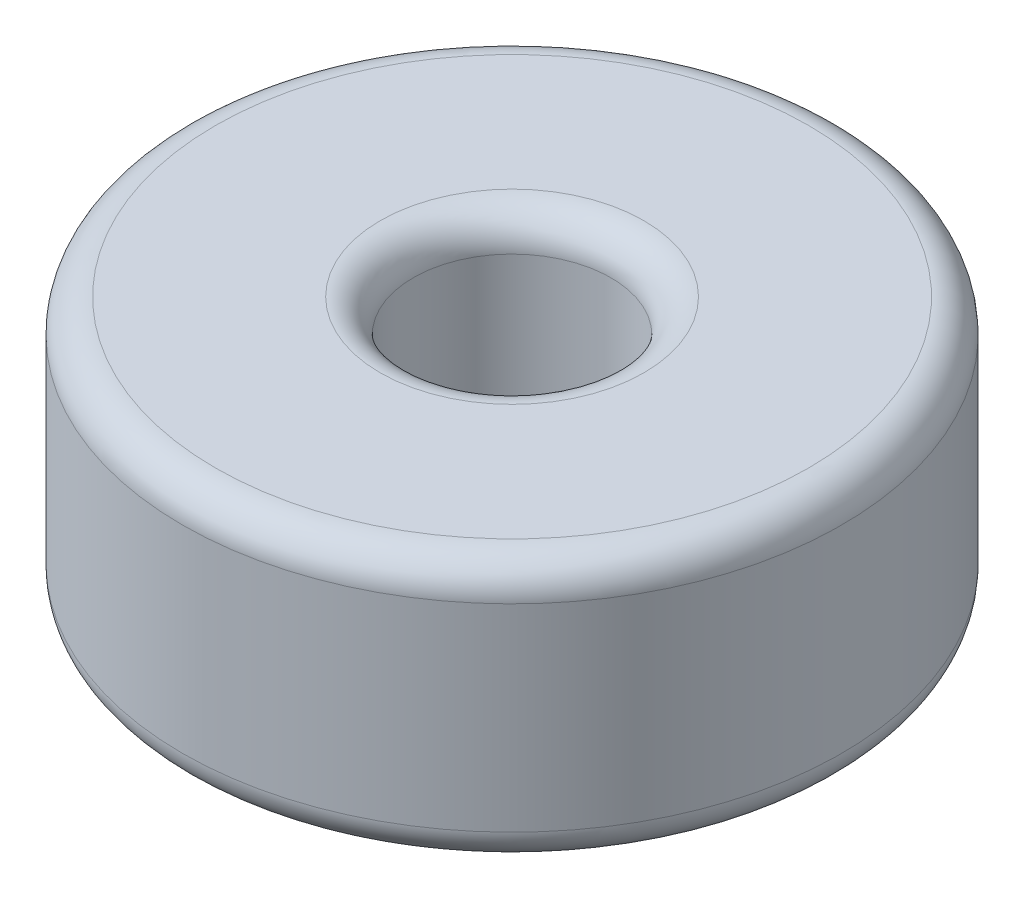
ISO-10303-21;
HEADER;
FILE_DESCRIPTION(('STEP AP214'),'2;1');
FILE_NAME('part.step','',(''),(''),'','','');
FILE_SCHEMA(('AUTOMOTIVE_DESIGN { 1 0 10303 214 1 1 1 1 }'));
ENDSEC;
DATA;
#1=APPLICATION_CONTEXT('core data for automotive mechanical design processes');
#2=APPLICATION_PROTOCOL_DEFINITION('international standard','automotive_design',2000,#1);
#3=PRODUCT_CONTEXT('',#1,'mechanical');
#4=PRODUCT('Part','Part','',(#3));
#5=PRODUCT_RELATED_PRODUCT_CATEGORY('part','',(#4));
#6=PRODUCT_DEFINITION_FORMATION('','',#4);
#7=PRODUCT_DEFINITION_CONTEXT('part definition',#1,'design');
#8=PRODUCT_DEFINITION('design','',#6,#7);
#9=PRODUCT_DEFINITION_SHAPE('','',#8);
#10=(LENGTH_UNIT() NAMED_UNIT(*) SI_UNIT(.MILLI.,.METRE.));
#11=(NAMED_UNIT(*) PLANE_ANGLE_UNIT() SI_UNIT($,.RADIAN.));
#12=(NAMED_UNIT(*) SI_UNIT($,.STERADIAN.) SOLID_ANGLE_UNIT());
#13=UNCERTAINTY_MEASURE_WITH_UNIT(LENGTH_MEASURE(1.E-05),#10,'distance_accuracy_value','');
#14=(GEOMETRIC_REPRESENTATION_CONTEXT(3) GLOBAL_UNCERTAINTY_ASSIGNED_CONTEXT((#13)) GLOBAL_UNIT_ASSIGNED_CONTEXT((#10,
#11,#12)) REPRESENTATION_CONTEXT('',''));
#15=CARTESIAN_POINT('',(0.,0.,0.));
#16=DIRECTION('',(0.,0.,1.));
#17=DIRECTION('',(1.,0.,0.));
#18=AXIS2_PLACEMENT_3D('',#15,#16,#17);
#19=CARTESIAN_POINT('',(0.,4.,0.));
#20=DIRECTION('',(0.,1.,0.));
#21=DIRECTION('',(0.,0.,1.));
#22=AXIS2_PLACEMENT_3D('',#19,#20,#21);
#23=PLANE('',#22);
#24=CARTESIAN_POINT('',(0.,4.,0.));
#25=DIRECTION('',(0.,1.,0.));
#26=DIRECTION('',(0.,0.,1.));
#27=AXIS2_PLACEMENT_3D('',#24,#25,#26);
#28=CIRCLE('',#27,2.);
#29=CARTESIAN_POINT('',(0.,4.,2.));
#30=VERTEX_POINT('',#29);
#31=EDGE_CURVE('E50',#30,#30,#28,.F.);
#32=ORIENTED_EDGE('',*,*,#31,.T.);
#33=EDGE_LOOP('',(#32));
#34=FACE_BOUND('',#33,.T.);
#35=CARTESIAN_POINT('',(0.,4.,0.));
#36=DIRECTION('',(0.,1.,0.));
#37=DIRECTION('',(0.,0.,1.));
#38=AXIS2_PLACEMENT_3D('',#35,#36,#37);
#39=CIRCLE('',#38,4.5);
#40=CARTESIAN_POINT('',(0.,4.,4.5));
#41=VERTEX_POINT('',#40);
#42=EDGE_CURVE('E55',#41,#41,#39,.T.);
#43=ORIENTED_EDGE('',*,*,#42,.T.);
#44=EDGE_LOOP('',(#43));
#45=FACE_BOUND('',#44,.T.);
#46=ADVANCED_FACE('F37',(#34,#45),#23,.T.);
#47=CARTESIAN_POINT('',(0.,0.,0.));
#48=DIRECTION('',(0.,1.,0.));
#49=DIRECTION('',(0.,0.,1.));
#50=AXIS2_PLACEMENT_3D('',#47,#48,#49);
#51=PLANE('',#50);
#52=CARTESIAN_POINT('',(0.,0.,0.));
#53=DIRECTION('',(0.,1.,0.));
#54=DIRECTION('',(0.,0.,1.));
#55=AXIS2_PLACEMENT_3D('',#52,#53,#54);
#56=CIRCLE('',#55,2.);
#57=CARTESIAN_POINT('',(0.,0.,2.));
#58=VERTEX_POINT('',#57);
#59=EDGE_CURVE('E69',#58,#58,#56,.T.);
#60=ORIENTED_EDGE('',*,*,#59,.T.);
#61=EDGE_LOOP('',(#60));
#62=FACE_BOUND('',#61,.T.);
#63=CARTESIAN_POINT('',(0.,0.,0.));
#64=DIRECTION('',(0.,1.,0.));
#65=DIRECTION('',(0.,0.,1.));
#66=AXIS2_PLACEMENT_3D('',#63,#64,#65);
#67=CIRCLE('',#66,4.5);
#68=CARTESIAN_POINT('',(0.,0.,4.5));
#69=VERTEX_POINT('',#68);
#70=EDGE_CURVE('E73',#69,#69,#67,.F.);
#71=ORIENTED_EDGE('',*,*,#70,.T.);
#72=EDGE_LOOP('',(#71));
#73=FACE_BOUND('',#72,.T.);
#74=ADVANCED_FACE('F78',(#62,#73),#51,.F.);
#75=CARTESIAN_POINT('',(0.,4.,0.));
#76=DIRECTION('',(0.,-1.,0.));
#77=DIRECTION('',(0.,0.,-1.));
#78=AXIS2_PLACEMENT_3D('',#75,#76,#77);
#79=CYLINDRICAL_SURFACE('',#78,5.);
#80=CARTESIAN_POINT('',(0.,0.5,0.));
#81=DIRECTION('',(0.,1.,0.));
#82=DIRECTION('',(0.,0.,1.));
#83=AXIS2_PLACEMENT_3D('',#80,#81,#82);
#84=CIRCLE('',#83,5.);
#85=CARTESIAN_POINT('',(0.,0.5,5.));
#86=VERTEX_POINT('',#85);
#87=EDGE_CURVE('E10',#86,#86,#84,.T.);
#88=ORIENTED_EDGE('',*,*,#87,.T.);
#89=EDGE_LOOP('',(#88));
#90=FACE_BOUND('',#89,.T.);
#91=CARTESIAN_POINT('',(0.,3.5,0.));
#92=DIRECTION('',(0.,1.,0.));
#93=DIRECTION('',(0.,0.,1.));
#94=AXIS2_PLACEMENT_3D('',#91,#92,#93);
#95=CIRCLE('',#94,5.);
#96=CARTESIAN_POINT('',(0.,3.5,5.));
#97=VERTEX_POINT('',#96);
#98=EDGE_CURVE('E45',#97,#97,#95,.F.);
#99=ORIENTED_EDGE('',*,*,#98,.T.);
#100=EDGE_LOOP('',(#99));
#101=FACE_BOUND('',#100,.T.);
#102=ADVANCED_FACE('F98',(#90,#101),#79,.T.);
#103=CARTESIAN_POINT('',(0.,4.,0.));
#104=DIRECTION('',(0.,-1.,0.));
#105=DIRECTION('',(0.,0.,-1.));
#106=AXIS2_PLACEMENT_3D('',#103,#104,#105);
#107=CYLINDRICAL_SURFACE('',#106,1.5);
#108=CARTESIAN_POINT('',(0.,0.5,0.));
#109=DIRECTION('',(0.,1.,0.));
#110=DIRECTION('',(0.,0.,1.));
#111=AXIS2_PLACEMENT_3D('',#108,#109,#110);
#112=CIRCLE('',#111,1.5);
#113=CARTESIAN_POINT('',(0.,0.5,1.5));
#114=VERTEX_POINT('',#113);
#115=EDGE_CURVE('E61',#114,#114,#112,.F.);
#116=ORIENTED_EDGE('',*,*,#115,.T.);
#117=EDGE_LOOP('',(#116));
#118=FACE_BOUND('',#117,.T.);
#119=CARTESIAN_POINT('',(0.,3.5,0.));
#120=DIRECTION('',(0.,1.,0.));
#121=DIRECTION('',(0.,0.,1.));
#122=AXIS2_PLACEMENT_3D('',#119,#120,#121);
#123=CIRCLE('',#122,1.5);
#124=CARTESIAN_POINT('',(0.,3.5,1.5));
#125=VERTEX_POINT('',#124);
#126=EDGE_CURVE('E65',#125,#125,#123,.T.);
#127=ORIENTED_EDGE('',*,*,#126,.T.);
#128=EDGE_LOOP('',(#127));
#129=FACE_BOUND('',#128,.T.);
#130=ADVANCED_FACE('F103',(#118,#129),#107,.F.);
#131=CARTESIAN_POINT('',(0.,0.5,0.));
#132=DIRECTION('',(0.,1.,0.));
#133=DIRECTION('',(0.,0.,1.));
#134=AXIS2_PLACEMENT_3D('',#131,#132,#133);
#135=TOROIDAL_SURFACE('',#134,2.,0.5);
#136=ORIENTED_EDGE('',*,*,#115,.F.);
#137=EDGE_LOOP('',(#136));
#138=FACE_BOUND('',#137,.T.);
#139=ORIENTED_EDGE('',*,*,#59,.F.);
#140=EDGE_LOOP('',(#139));
#141=FACE_BOUND('',#140,.T.);
#142=ADVANCED_FACE('F89',(#138,#141),#135,.T.);
#143=CARTESIAN_POINT('',(0.,3.5,0.));
#144=DIRECTION('',(0.,1.,0.));
#145=DIRECTION('',(0.,0.,1.));
#146=AXIS2_PLACEMENT_3D('',#143,#144,#145);
#147=TOROIDAL_SURFACE('',#146,2.,0.5);
#148=ORIENTED_EDGE('',*,*,#31,.F.);
#149=EDGE_LOOP('',(#148));
#150=FACE_BOUND('',#149,.T.);
#151=ORIENTED_EDGE('',*,*,#126,.F.);
#152=EDGE_LOOP('',(#151));
#153=FACE_BOUND('',#152,.T.);
#154=ADVANCED_FACE('F83',(#150,#153),#147,.T.);
#155=CARTESIAN_POINT('',(0.,0.5,0.));
#156=DIRECTION('',(0.,1.,0.));
#157=DIRECTION('',(0.,0.,1.));
#158=AXIS2_PLACEMENT_3D('',#155,#156,#157);
#159=TOROIDAL_SURFACE('',#158,4.5,0.5);
#160=ORIENTED_EDGE('',*,*,#70,.F.);
#161=EDGE_LOOP('',(#160));
#162=FACE_BOUND('',#161,.T.);
#163=ORIENTED_EDGE('',*,*,#87,.F.);
#164=EDGE_LOOP('',(#163));
#165=FACE_BOUND('',#164,.T.);
#166=ADVANCED_FACE('F80',(#162,#165),#159,.T.);
#167=CARTESIAN_POINT('',(0.,3.5,0.));
#168=DIRECTION('',(0.,1.,0.));
#169=DIRECTION('',(0.,0.,1.));
#170=AXIS2_PLACEMENT_3D('',#167,#168,#169);
#171=TOROIDAL_SURFACE('',#170,4.5,0.5);
#172=ORIENTED_EDGE('',*,*,#98,.F.);
#173=EDGE_LOOP('',(#172));
#174=FACE_BOUND('',#173,.T.);
#175=ORIENTED_EDGE('',*,*,#42,.F.);
#176=EDGE_LOOP('',(#175));
#177=FACE_BOUND('',#176,.T.);
#178=ADVANCED_FACE('F39',(#174,#177),#171,.T.);
#179=CLOSED_SHELL('',(#46,#74,#102,#130,#142,#154,#166,#178));
#180=MANIFOLD_SOLID_BREP('B2',#179);
#181=ADVANCED_BREP_SHAPE_REPRESENTATION('',(#18,#180),#14);
#182=SHAPE_DEFINITION_REPRESENTATION(#9,#181);
ENDSEC;
END-ISO-10303-21;
